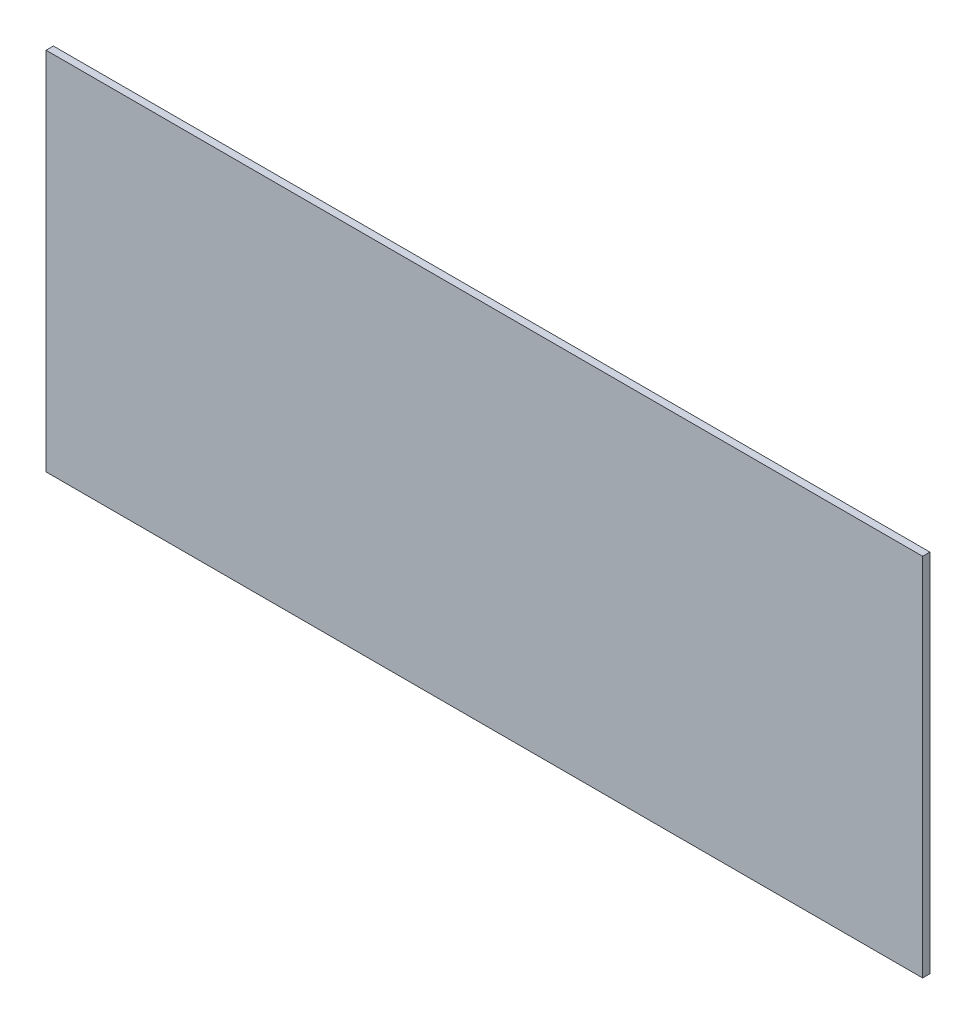
ISO-10303-21;
HEADER;
FILE_DESCRIPTION(('STEP AP214'),'2;1');
FILE_NAME('part.step','',(''),(''),'','','');
FILE_SCHEMA(('AUTOMOTIVE_DESIGN { 1 0 10303 214 1 1 1 1 }'));
ENDSEC;
DATA;
#1=APPLICATION_CONTEXT('core data for automotive mechanical design processes');
#2=APPLICATION_PROTOCOL_DEFINITION('international standard','automotive_design',2000,#1);
#3=PRODUCT_CONTEXT('',#1,'mechanical');
#4=PRODUCT('Part','Part','',(#3));
#5=PRODUCT_RELATED_PRODUCT_CATEGORY('part','',(#4));
#6=PRODUCT_DEFINITION_FORMATION('','',#4);
#7=PRODUCT_DEFINITION_CONTEXT('part definition',#1,'design');
#8=PRODUCT_DEFINITION('design','',#6,#7);
#9=PRODUCT_DEFINITION_SHAPE('','',#8);
#10=(LENGTH_UNIT() NAMED_UNIT(*) SI_UNIT(.MILLI.,.METRE.));
#11=(NAMED_UNIT(*) PLANE_ANGLE_UNIT() SI_UNIT($,.RADIAN.));
#12=(NAMED_UNIT(*) SI_UNIT($,.STERADIAN.) SOLID_ANGLE_UNIT());
#13=UNCERTAINTY_MEASURE_WITH_UNIT(LENGTH_MEASURE(1.E-05),#10,'distance_accuracy_value','');
#14=(GEOMETRIC_REPRESENTATION_CONTEXT(3) GLOBAL_UNCERTAINTY_ASSIGNED_CONTEXT((#13)) GLOBAL_UNIT_ASSIGNED_CONTEXT((#10,
#11,#12)) REPRESENTATION_CONTEXT('',''));
#15=CARTESIAN_POINT('',(0.,0.,0.));
#16=DIRECTION('',(0.,0.,1.));
#17=DIRECTION('',(1.,0.,0.));
#18=AXIS2_PLACEMENT_3D('',#15,#16,#17);
#19=CARTESIAN_POINT('',(240.,0.,2.));
#20=DIRECTION('',(0.,1.,0.));
#21=DIRECTION('',(-1.,0.,0.));
#22=AXIS2_PLACEMENT_3D('',#19,#20,#21);
#23=PLANE('',#22);
#24=DIRECTION('',(1.,0.,0.));
#25=VECTOR('',#24,1.);
#26=CARTESIAN_POINT('',(240.,0.,0.));
#27=LINE('',#26,#25);
#28=CARTESIAN_POINT('',(0.,0.,0.));
#29=VERTEX_POINT('',#28);
#30=CARTESIAN_POINT('',(240.,0.,0.));
#31=VERTEX_POINT('',#30);
#32=EDGE_CURVE('E96',#29,#31,#27,.T.);
#33=ORIENTED_EDGE('',*,*,#32,.T.);
#34=DIRECTION('',(0.,0.,-1.));
#35=VECTOR('',#34,1.);
#36=CARTESIAN_POINT('',(240.,0.,2.));
#37=LINE('',#36,#35);
#38=CARTESIAN_POINT('',(240.,0.,2.));
#39=VERTEX_POINT('',#38);
#40=EDGE_CURVE('E11',#39,#31,#37,.T.);
#41=ORIENTED_EDGE('',*,*,#40,.F.);
#42=DIRECTION('',(1.,0.,0.));
#43=VECTOR('',#42,1.);
#44=CARTESIAN_POINT('',(240.,0.,2.));
#45=LINE('',#44,#43);
#46=CARTESIAN_POINT('',(0.,0.,2.));
#47=VERTEX_POINT('',#46);
#48=EDGE_CURVE('E84',#47,#39,#45,.T.);
#49=ORIENTED_EDGE('',*,*,#48,.F.);
#50=DIRECTION('',(0.,0.,-1.));
#51=VECTOR('',#50,1.);
#52=CARTESIAN_POINT('',(0.,0.,2.));
#53=LINE('',#52,#51);
#54=EDGE_CURVE('E92',#47,#29,#53,.T.);
#55=ORIENTED_EDGE('',*,*,#54,.T.);
#56=EDGE_LOOP('',(#33,#41,#49,#55));
#57=FACE_BOUND('',#56,.T.);
#58=ADVANCED_FACE('F33',(#57),#23,.F.);
#59=CARTESIAN_POINT('',(240.,100.,2.));
#60=DIRECTION('',(-1.,0.,0.));
#61=DIRECTION('',(0.,0.,1.));
#62=AXIS2_PLACEMENT_3D('',#59,#60,#61);
#63=PLANE('',#62);
#64=DIRECTION('',(0.,1.,0.));
#65=VECTOR('',#64,1.);
#66=CARTESIAN_POINT('',(240.,100.,0.));
#67=LINE('',#66,#65);
#68=CARTESIAN_POINT('',(240.,100.,0.));
#69=VERTEX_POINT('',#68);
#70=EDGE_CURVE('E88',#31,#69,#67,.T.);
#71=ORIENTED_EDGE('',*,*,#70,.T.);
#72=DIRECTION('',(0.,0.,-1.));
#73=VECTOR('',#72,1.);
#74=CARTESIAN_POINT('',(240.,100.,2.));
#75=LINE('',#74,#73);
#76=CARTESIAN_POINT('',(240.,100.,2.));
#77=VERTEX_POINT('',#76);
#78=EDGE_CURVE('E41',#77,#69,#75,.T.);
#79=ORIENTED_EDGE('',*,*,#78,.F.);
#80=DIRECTION('',(0.,1.,0.));
#81=VECTOR('',#80,1.);
#82=CARTESIAN_POINT('',(240.,100.,2.));
#83=LINE('',#82,#81);
#84=EDGE_CURVE('E79',#39,#77,#83,.T.);
#85=ORIENTED_EDGE('',*,*,#84,.F.);
#86=ORIENTED_EDGE('',*,*,#40,.T.);
#87=EDGE_LOOP('',(#71,#79,#85,#86));
#88=FACE_BOUND('',#87,.T.);
#89=ADVANCED_FACE('F87',(#88),#63,.F.);
#90=CARTESIAN_POINT('',(0.,100.,2.));
#91=DIRECTION('',(0.,-1.,0.));
#92=DIRECTION('',(0.,0.,-1.));
#93=AXIS2_PLACEMENT_3D('',#90,#91,#92);
#94=PLANE('',#93);
#95=DIRECTION('',(-1.,0.,0.));
#96=VECTOR('',#95,1.);
#97=CARTESIAN_POINT('',(0.,100.,0.));
#98=LINE('',#97,#96);
#99=CARTESIAN_POINT('',(0.,100.,0.));
#100=VERTEX_POINT('',#99);
#101=EDGE_CURVE('E66',#69,#100,#98,.T.);
#102=ORIENTED_EDGE('',*,*,#101,.T.);
#103=DIRECTION('',(0.,0.,-1.));
#104=VECTOR('',#103,1.);
#105=CARTESIAN_POINT('',(0.,100.,2.));
#106=LINE('',#105,#104);
#107=CARTESIAN_POINT('',(0.,100.,2.));
#108=VERTEX_POINT('',#107);
#109=EDGE_CURVE('E89',#108,#100,#106,.T.);
#110=ORIENTED_EDGE('',*,*,#109,.F.);
#111=DIRECTION('',(-1.,0.,0.));
#112=VECTOR('',#111,1.);
#113=CARTESIAN_POINT('',(0.,100.,2.));
#114=LINE('',#113,#112);
#115=EDGE_CURVE('E82',#77,#108,#114,.T.);
#116=ORIENTED_EDGE('',*,*,#115,.F.);
#117=ORIENTED_EDGE('',*,*,#78,.T.);
#118=EDGE_LOOP('',(#102,#110,#116,#117));
#119=FACE_BOUND('',#118,.T.);
#120=ADVANCED_FACE('F90',(#119),#94,.F.);
#121=CARTESIAN_POINT('',(0.,0.,2.));
#122=DIRECTION('',(1.,0.,0.));
#123=DIRECTION('',(0.,0.,-1.));
#124=AXIS2_PLACEMENT_3D('',#121,#122,#123);
#125=PLANE('',#124);
#126=DIRECTION('',(0.,-1.,0.));
#127=VECTOR('',#126,1.);
#128=CARTESIAN_POINT('',(0.,0.,0.));
#129=LINE('',#128,#127);
#130=EDGE_CURVE('E72',#100,#29,#129,.T.);
#131=ORIENTED_EDGE('',*,*,#130,.T.);
#132=ORIENTED_EDGE('',*,*,#54,.F.);
#133=DIRECTION('',(0.,-1.,0.));
#134=VECTOR('',#133,1.);
#135=CARTESIAN_POINT('',(0.,0.,2.));
#136=LINE('',#135,#134);
#137=EDGE_CURVE('E49',#108,#47,#136,.T.);
#138=ORIENTED_EDGE('',*,*,#137,.F.);
#139=ORIENTED_EDGE('',*,*,#109,.T.);
#140=EDGE_LOOP('',(#131,#132,#138,#139));
#141=FACE_BOUND('',#140,.T.);
#142=ADVANCED_FACE('F103',(#141),#125,.F.);
#143=CARTESIAN_POINT('',(0.,0.,2.));
#144=DIRECTION('',(0.,0.,-1.));
#145=DIRECTION('',(-1.,0.,0.));
#146=AXIS2_PLACEMENT_3D('',#143,#144,#145);
#147=PLANE('',#146);
#148=ORIENTED_EDGE('',*,*,#48,.T.);
#149=ORIENTED_EDGE('',*,*,#84,.T.);
#150=ORIENTED_EDGE('',*,*,#115,.T.);
#151=ORIENTED_EDGE('',*,*,#137,.T.);
#152=EDGE_LOOP('',(#148,#149,#150,#151));
#153=FACE_BOUND('',#152,.T.);
#154=ADVANCED_FACE('F80',(#153),#147,.F.);
#155=CARTESIAN_POINT('',(0.,0.,0.));
#156=DIRECTION('',(0.,0.,-1.));
#157=DIRECTION('',(-1.,0.,0.));
#158=AXIS2_PLACEMENT_3D('',#155,#156,#157);
#159=PLANE('',#158);
#160=ORIENTED_EDGE('',*,*,#32,.F.);
#161=ORIENTED_EDGE('',*,*,#130,.F.);
#162=ORIENTED_EDGE('',*,*,#101,.F.);
#163=ORIENTED_EDGE('',*,*,#70,.F.);
#164=EDGE_LOOP('',(#160,#161,#162,#163));
#165=FACE_BOUND('',#164,.T.);
#166=ADVANCED_FACE('F106',(#165),#159,.T.);
#167=CLOSED_SHELL('',(#58,#89,#120,#142,#154,#166));
#168=MANIFOLD_SOLID_BREP('B2',#167);
#169=ADVANCED_BREP_SHAPE_REPRESENTATION('',(#18,#168),#14);
#170=SHAPE_DEFINITION_REPRESENTATION(#9,#169);
ENDSEC;
END-ISO-10303-21;
